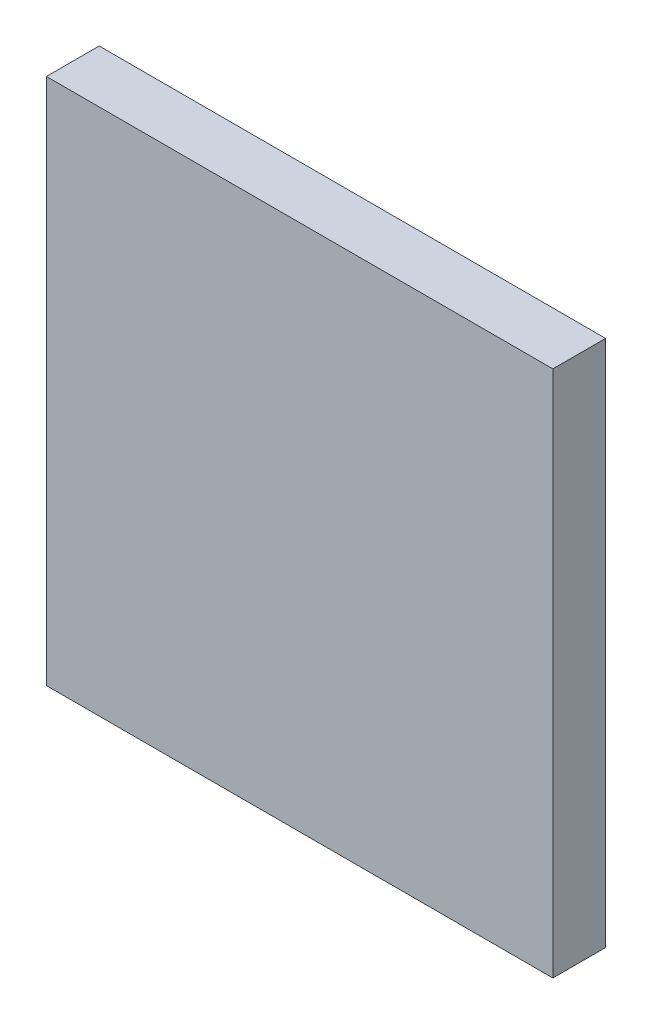
ISO-10303-21;
HEADER;
FILE_DESCRIPTION(('STEP AP214'),'2;1');
FILE_NAME('part.step','',(''),(''),'','','');
FILE_SCHEMA(('AUTOMOTIVE_DESIGN { 1 0 10303 214 1 1 1 1 }'));
ENDSEC;
DATA;
#1=APPLICATION_CONTEXT('core data for automotive mechanical design processes');
#2=APPLICATION_PROTOCOL_DEFINITION('international standard','automotive_design',2000,#1);
#3=PRODUCT_CONTEXT('',#1,'mechanical');
#4=PRODUCT('Part','Part','',(#3));
#5=PRODUCT_RELATED_PRODUCT_CATEGORY('part','',(#4));
#6=PRODUCT_DEFINITION_FORMATION('','',#4);
#7=PRODUCT_DEFINITION_CONTEXT('part definition',#1,'design');
#8=PRODUCT_DEFINITION('design','',#6,#7);
#9=PRODUCT_DEFINITION_SHAPE('','',#8);
#10=(LENGTH_UNIT() NAMED_UNIT(*) SI_UNIT(.MILLI.,.METRE.));
#11=(NAMED_UNIT(*) PLANE_ANGLE_UNIT() SI_UNIT($,.RADIAN.));
#12=(NAMED_UNIT(*) SI_UNIT($,.STERADIAN.) SOLID_ANGLE_UNIT());
#13=UNCERTAINTY_MEASURE_WITH_UNIT(LENGTH_MEASURE(1.E-05),#10,'distance_accuracy_value','');
#14=(GEOMETRIC_REPRESENTATION_CONTEXT(3) GLOBAL_UNCERTAINTY_ASSIGNED_CONTEXT((#13)) GLOBAL_UNIT_ASSIGNED_CONTEXT((#10,
#11,#12)) REPRESENTATION_CONTEXT('',''));
#15=CARTESIAN_POINT('',(0.,0.,0.));
#16=DIRECTION('',(0.,0.,1.));
#17=DIRECTION('',(1.,0.,0.));
#18=AXIS2_PLACEMENT_3D('',#15,#16,#17);
#19=CARTESIAN_POINT('',(0.,0.,25.));
#20=DIRECTION('',(1.,0.,0.));
#21=DIRECTION('',(0.,0.,-1.));
#22=AXIS2_PLACEMENT_3D('',#19,#20,#21);
#23=PLANE('',#22);
#24=DIRECTION('',(0.,-1.,0.));
#25=VECTOR('',#24,1.);
#26=CARTESIAN_POINT('',(0.,0.,0.));
#27=LINE('',#26,#25);
#28=CARTESIAN_POINT('',(0.,250.,0.));
#29=VERTEX_POINT('',#28);
#30=CARTESIAN_POINT('',(0.,0.,0.));
#31=VERTEX_POINT('',#30);
#32=EDGE_CURVE('E111',#29,#31,#27,.T.);
#33=ORIENTED_EDGE('',*,*,#32,.T.);
#34=DIRECTION('',(0.,0.,-1.));
#35=VECTOR('',#34,1.);
#36=CARTESIAN_POINT('',(0.,0.,25.));
#37=LINE('',#36,#35);
#38=CARTESIAN_POINT('',(0.,0.,25.));
#39=VERTEX_POINT('',#38);
#40=EDGE_CURVE('E11',#39,#31,#37,.T.);
#41=ORIENTED_EDGE('',*,*,#40,.F.);
#42=DIRECTION('',(0.,-1.,0.));
#43=VECTOR('',#42,1.);
#44=CARTESIAN_POINT('',(0.,0.,25.));
#45=LINE('',#44,#43);
#46=CARTESIAN_POINT('',(0.,250.,25.));
#47=VERTEX_POINT('',#46);
#48=EDGE_CURVE('E95',#47,#39,#45,.T.);
#49=ORIENTED_EDGE('',*,*,#48,.F.);
#50=DIRECTION('',(0.,0.,-1.));
#51=VECTOR('',#50,1.);
#52=CARTESIAN_POINT('',(0.,250.,25.));
#53=LINE('',#52,#51);
#54=EDGE_CURVE('E107',#47,#29,#53,.T.);
#55=ORIENTED_EDGE('',*,*,#54,.T.);
#56=EDGE_LOOP('',(#33,#41,#49,#55));
#57=FACE_BOUND('',#56,.T.);
#58=ADVANCED_FACE('F43',(#57),#23,.F.);
#59=CARTESIAN_POINT('',(0.,0.,25.));
#60=DIRECTION('',(0.,1.,0.));
#61=DIRECTION('',(0.,0.,1.));
#62=AXIS2_PLACEMENT_3D('',#59,#60,#61);
#63=PLANE('',#62);
#64=DIRECTION('',(1.,0.,0.));
#65=VECTOR('',#64,1.);
#66=CARTESIAN_POINT('',(0.,0.,0.));
#67=LINE('',#66,#65);
#68=CARTESIAN_POINT('',(240.,0.,0.));
#69=VERTEX_POINT('',#68);
#70=EDGE_CURVE('E100',#31,#69,#67,.T.);
#71=ORIENTED_EDGE('',*,*,#70,.T.);
#72=DIRECTION('',(0.,0.,-1.));
#73=VECTOR('',#72,1.);
#74=CARTESIAN_POINT('',(240.,0.,25.));
#75=LINE('',#74,#73);
#76=CARTESIAN_POINT('',(240.,0.,25.));
#77=VERTEX_POINT('',#76);
#78=EDGE_CURVE('E52',#77,#69,#75,.T.);
#79=ORIENTED_EDGE('',*,*,#78,.F.);
#80=DIRECTION('',(1.,0.,0.));
#81=VECTOR('',#80,1.);
#82=CARTESIAN_POINT('',(0.,0.,25.));
#83=LINE('',#82,#81);
#84=EDGE_CURVE('E90',#39,#77,#83,.T.);
#85=ORIENTED_EDGE('',*,*,#84,.F.);
#86=ORIENTED_EDGE('',*,*,#40,.T.);
#87=EDGE_LOOP('',(#71,#79,#85,#86));
#88=FACE_BOUND('',#87,.T.);
#89=ADVANCED_FACE('F99',(#88),#63,.F.);
#90=CARTESIAN_POINT('',(240.,0.,25.));
#91=DIRECTION('',(-1.,0.,0.));
#92=DIRECTION('',(0.,0.,1.));
#93=AXIS2_PLACEMENT_3D('',#90,#91,#92);
#94=PLANE('',#93);
#95=DIRECTION('',(0.,1.,0.));
#96=VECTOR('',#95,1.);
#97=CARTESIAN_POINT('',(240.,0.,0.));
#98=LINE('',#97,#96);
#99=CARTESIAN_POINT('',(240.,250.,0.));
#100=VERTEX_POINT('',#99);
#101=EDGE_CURVE('E77',#69,#100,#98,.T.);
#102=ORIENTED_EDGE('',*,*,#101,.T.);
#103=DIRECTION('',(0.,0.,-1.));
#104=VECTOR('',#103,1.);
#105=CARTESIAN_POINT('',(240.,250.,25.));
#106=LINE('',#105,#104);
#107=CARTESIAN_POINT('',(240.,250.,25.));
#108=VERTEX_POINT('',#107);
#109=EDGE_CURVE('E102',#108,#100,#106,.T.);
#110=ORIENTED_EDGE('',*,*,#109,.F.);
#111=DIRECTION('',(0.,1.,0.));
#112=VECTOR('',#111,1.);
#113=CARTESIAN_POINT('',(240.,0.,25.));
#114=LINE('',#113,#112);
#115=EDGE_CURVE('E93',#77,#108,#114,.T.);
#116=ORIENTED_EDGE('',*,*,#115,.F.);
#117=ORIENTED_EDGE('',*,*,#78,.T.);
#118=EDGE_LOOP('',(#102,#110,#116,#117));
#119=FACE_BOUND('',#118,.T.);
#120=ADVANCED_FACE('F103',(#119),#94,.F.);
#121=CARTESIAN_POINT('',(0.,250.,25.));
#122=DIRECTION('',(0.,-1.,0.));
#123=DIRECTION('',(0.,0.,-1.));
#124=AXIS2_PLACEMENT_3D('',#121,#122,#123);
#125=PLANE('',#124);
#126=DIRECTION('',(-1.,0.,0.));
#127=VECTOR('',#126,1.);
#128=CARTESIAN_POINT('',(0.,250.,0.));
#129=LINE('',#128,#127);
#130=EDGE_CURVE('E83',#100,#29,#129,.T.);
#131=ORIENTED_EDGE('',*,*,#130,.T.);
#132=ORIENTED_EDGE('',*,*,#54,.F.);
#133=DIRECTION('',(-1.,0.,0.));
#134=VECTOR('',#133,1.);
#135=CARTESIAN_POINT('',(0.,250.,25.));
#136=LINE('',#135,#134);
#137=EDGE_CURVE('E60',#108,#47,#136,.T.);
#138=ORIENTED_EDGE('',*,*,#137,.F.);
#139=ORIENTED_EDGE('',*,*,#109,.T.);
#140=EDGE_LOOP('',(#131,#132,#138,#139));
#141=FACE_BOUND('',#140,.T.);
#142=ADVANCED_FACE('F124',(#141),#125,.F.);
#143=CARTESIAN_POINT('',(0.,0.,25.));
#144=DIRECTION('',(0.,0.,-1.));
#145=DIRECTION('',(-1.,0.,0.));
#146=AXIS2_PLACEMENT_3D('',#143,#144,#145);
#147=PLANE('',#146);
#148=ORIENTED_EDGE('',*,*,#48,.T.);
#149=ORIENTED_EDGE('',*,*,#84,.T.);
#150=ORIENTED_EDGE('',*,*,#115,.T.);
#151=ORIENTED_EDGE('',*,*,#137,.T.);
#152=EDGE_LOOP('',(#148,#149,#150,#151));
#153=FACE_BOUND('',#152,.T.);
#154=ADVANCED_FACE('F91',(#153),#147,.F.);
#155=CARTESIAN_POINT('',(0.,0.,0.));
#156=DIRECTION('',(0.,0.,-1.));
#157=DIRECTION('',(-1.,0.,0.));
#158=AXIS2_PLACEMENT_3D('',#155,#156,#157);
#159=PLANE('',#158);
#160=ORIENTED_EDGE('',*,*,#32,.F.);
#161=ORIENTED_EDGE('',*,*,#130,.F.);
#162=ORIENTED_EDGE('',*,*,#101,.F.);
#163=ORIENTED_EDGE('',*,*,#70,.F.);
#164=EDGE_LOOP('',(#160,#161,#162,#163));
#165=FACE_BOUND('',#164,.T.);
#166=ADVANCED_FACE('F127',(#165),#159,.T.);
#167=CLOSED_SHELL('',(#58,#89,#120,#142,#154,#166));
#168=MANIFOLD_SOLID_BREP('B2',#167);
#169=ADVANCED_BREP_SHAPE_REPRESENTATION('',(#18,#168),#14);
#170=SHAPE_DEFINITION_REPRESENTATION(#9,#169);
ENDSEC;
END-ISO-10303-21;
